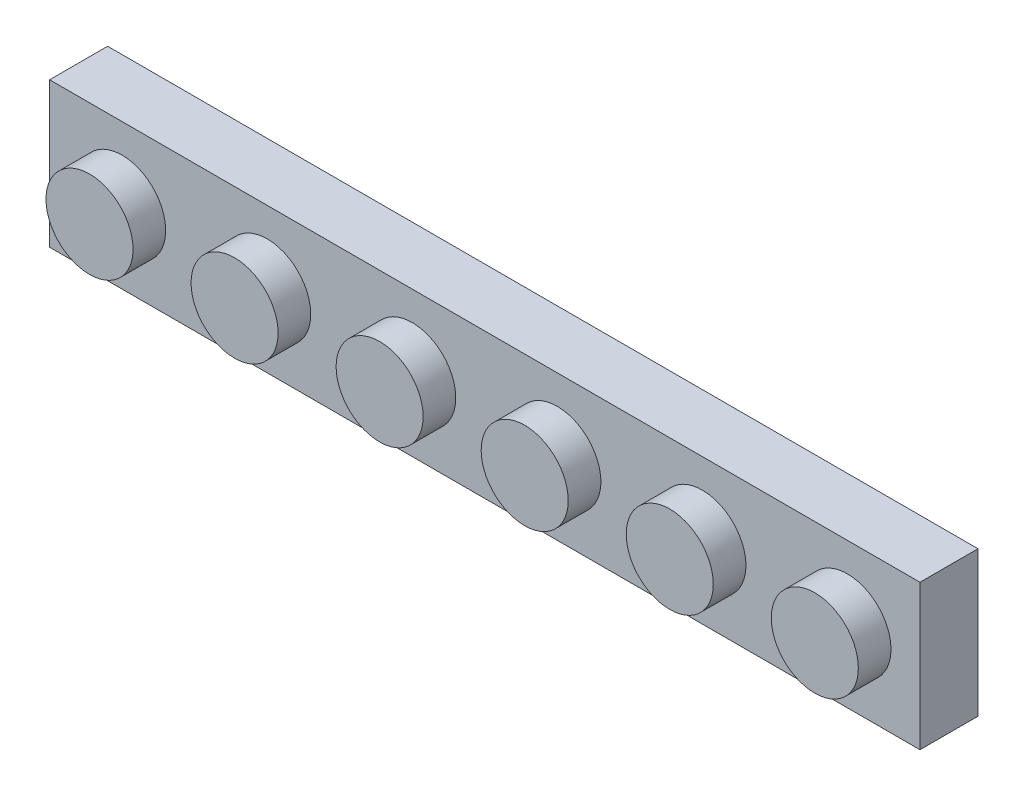
ISO-10303-21;
HEADER;
FILE_DESCRIPTION(('STEP AP214'),'2;1');
FILE_NAME('part.step','',(''),(''),'','','');
FILE_SCHEMA(('AUTOMOTIVE_DESIGN { 1 0 10303 214 1 1 1 1 }'));
ENDSEC;
DATA;
#1=APPLICATION_CONTEXT('core data for automotive mechanical design processes');
#2=APPLICATION_PROTOCOL_DEFINITION('international standard','automotive_design',2000,#1);
#3=PRODUCT_CONTEXT('',#1,'mechanical');
#4=PRODUCT('Part','Part','',(#3));
#5=PRODUCT_RELATED_PRODUCT_CATEGORY('part','',(#4));
#6=PRODUCT_DEFINITION_FORMATION('','',#4);
#7=PRODUCT_DEFINITION_CONTEXT('part definition',#1,'design');
#8=PRODUCT_DEFINITION('design','',#6,#7);
#9=PRODUCT_DEFINITION_SHAPE('','',#8);
#10=(LENGTH_UNIT() NAMED_UNIT(*) SI_UNIT(.MILLI.,.METRE.));
#11=(NAMED_UNIT(*) PLANE_ANGLE_UNIT() SI_UNIT($,.RADIAN.));
#12=(NAMED_UNIT(*) SI_UNIT($,.STERADIAN.) SOLID_ANGLE_UNIT());
#13=UNCERTAINTY_MEASURE_WITH_UNIT(LENGTH_MEASURE(1.E-05),#10,'distance_accuracy_value','');
#14=(GEOMETRIC_REPRESENTATION_CONTEXT(3) GLOBAL_UNCERTAINTY_ASSIGNED_CONTEXT((#13)) GLOBAL_UNIT_ASSIGNED_CONTEXT((#10,
#11,#12)) REPRESENTATION_CONTEXT('',''));
#15=CARTESIAN_POINT('',(0.,0.,0.));
#16=DIRECTION('',(0.,0.,1.));
#17=DIRECTION('',(1.,0.,0.));
#18=AXIS2_PLACEMENT_3D('',#15,#16,#17);
#19=CARTESIAN_POINT('',(44.,4.,5.));
#20=DIRECTION('',(0.,0.,1.));
#21=DIRECTION('',(1.,0.,0.));
#22=AXIS2_PLACEMENT_3D('',#19,#20,#21);
#23=PLANE('',#22);
#24=CARTESIAN_POINT('',(44.,4.,5.));
#25=DIRECTION('',(0.,0.,1.));
#26=DIRECTION('',(1.,0.,0.));
#27=AXIS2_PLACEMENT_3D('',#24,#25,#26);
#28=CIRCLE('',#27,2.4);
#29=CARTESIAN_POINT('',(46.4,4.,5.));
#30=VERTEX_POINT('',#29);
#31=EDGE_CURVE('E11',#30,#30,#28,.T.);
#32=ORIENTED_EDGE('',*,*,#31,.T.);
#33=EDGE_LOOP('',(#32));
#34=FACE_BOUND('',#33,.T.);
#35=ADVANCED_FACE('F34',(#34),#23,.T.);
#36=CARTESIAN_POINT('',(44.,4.,5.));
#37=DIRECTION('',(0.,0.,-1.));
#38=DIRECTION('',(-1.,0.,0.));
#39=AXIS2_PLACEMENT_3D('',#36,#37,#38);
#40=CYLINDRICAL_SURFACE('',#39,2.4);
#41=ORIENTED_EDGE('',*,*,#31,.F.);
#42=EDGE_LOOP('',(#41));
#43=FACE_BOUND('',#42,.T.);
#44=CARTESIAN_POINT('',(44.,4.,3.2));
#45=DIRECTION('',(0.,0.,-1.));
#46=DIRECTION('',(-1.,0.,0.));
#47=AXIS2_PLACEMENT_3D('',#44,#45,#46);
#48=CIRCLE('',#47,2.4);
#49=CARTESIAN_POINT('',(41.6,4.,3.2));
#50=VERTEX_POINT('',#49);
#51=EDGE_CURVE('E41',#50,#50,#48,.F.);
#52=ORIENTED_EDGE('',*,*,#51,.T.);
#53=EDGE_LOOP('',(#52));
#54=FACE_BOUND('',#53,.T.);
#55=ADVANCED_FACE('F198',(#43,#54),#40,.T.);
#56=CARTESIAN_POINT('',(36.,4.,5.));
#57=DIRECTION('',(0.,0.,1.));
#58=DIRECTION('',(1.,0.,0.));
#59=AXIS2_PLACEMENT_3D('',#56,#57,#58);
#60=PLANE('',#59);
#61=CARTESIAN_POINT('',(36.,4.,5.));
#62=DIRECTION('',(0.,0.,1.));
#63=DIRECTION('',(1.,0.,0.));
#64=AXIS2_PLACEMENT_3D('',#61,#62,#63);
#65=CIRCLE('',#64,2.4);
#66=CARTESIAN_POINT('',(38.4,4.,5.));
#67=VERTEX_POINT('',#66);
#68=EDGE_CURVE('E193',#67,#67,#65,.T.);
#69=ORIENTED_EDGE('',*,*,#68,.T.);
#70=EDGE_LOOP('',(#69));
#71=FACE_BOUND('',#70,.T.);
#72=ADVANCED_FACE('F222',(#71),#60,.T.);
#73=CARTESIAN_POINT('',(36.,4.,5.));
#74=DIRECTION('',(0.,0.,-1.));
#75=DIRECTION('',(-1.,0.,0.));
#76=AXIS2_PLACEMENT_3D('',#73,#74,#75);
#77=CYLINDRICAL_SURFACE('',#76,2.4);
#78=ORIENTED_EDGE('',*,*,#68,.F.);
#79=EDGE_LOOP('',(#78));
#80=FACE_BOUND('',#79,.T.);
#81=CARTESIAN_POINT('',(36.,4.,3.2));
#82=DIRECTION('',(0.,0.,-1.));
#83=DIRECTION('',(-1.,0.,0.));
#84=AXIS2_PLACEMENT_3D('',#81,#82,#83);
#85=CIRCLE('',#84,2.4);
#86=CARTESIAN_POINT('',(33.6,4.,3.2));
#87=VERTEX_POINT('',#86);
#88=EDGE_CURVE('E190',#87,#87,#85,.F.);
#89=ORIENTED_EDGE('',*,*,#88,.T.);
#90=EDGE_LOOP('',(#89));
#91=FACE_BOUND('',#90,.T.);
#92=ADVANCED_FACE('F228',(#80,#91),#77,.T.);
#93=CARTESIAN_POINT('',(28.,4.,5.));
#94=DIRECTION('',(0.,0.,1.));
#95=DIRECTION('',(1.,0.,0.));
#96=AXIS2_PLACEMENT_3D('',#93,#94,#95);
#97=PLANE('',#96);
#98=CARTESIAN_POINT('',(28.,4.,5.));
#99=DIRECTION('',(0.,0.,1.));
#100=DIRECTION('',(1.,0.,0.));
#101=AXIS2_PLACEMENT_3D('',#98,#99,#100);
#102=CIRCLE('',#101,2.4);
#103=CARTESIAN_POINT('',(30.4,4.,5.));
#104=VERTEX_POINT('',#103);
#105=EDGE_CURVE('E187',#104,#104,#102,.T.);
#106=ORIENTED_EDGE('',*,*,#105,.T.);
#107=EDGE_LOOP('',(#106));
#108=FACE_BOUND('',#107,.T.);
#109=ADVANCED_FACE('F234',(#108),#97,.T.);
#110=CARTESIAN_POINT('',(28.,4.,5.));
#111=DIRECTION('',(0.,0.,-1.));
#112=DIRECTION('',(-1.,0.,0.));
#113=AXIS2_PLACEMENT_3D('',#110,#111,#112);
#114=CYLINDRICAL_SURFACE('',#113,2.4);
#115=ORIENTED_EDGE('',*,*,#105,.F.);
#116=EDGE_LOOP('',(#115));
#117=FACE_BOUND('',#116,.T.);
#118=CARTESIAN_POINT('',(28.,4.,3.2));
#119=DIRECTION('',(0.,0.,-1.));
#120=DIRECTION('',(-1.,0.,0.));
#121=AXIS2_PLACEMENT_3D('',#118,#119,#120);
#122=CIRCLE('',#121,2.4);
#123=CARTESIAN_POINT('',(25.6,4.,3.2));
#124=VERTEX_POINT('',#123);
#125=EDGE_CURVE('E184',#124,#124,#122,.F.);
#126=ORIENTED_EDGE('',*,*,#125,.T.);
#127=EDGE_LOOP('',(#126));
#128=FACE_BOUND('',#127,.T.);
#129=ADVANCED_FACE('F238',(#117,#128),#114,.T.);
#130=CARTESIAN_POINT('',(20.,4.,5.));
#131=DIRECTION('',(0.,0.,1.));
#132=DIRECTION('',(1.,0.,0.));
#133=AXIS2_PLACEMENT_3D('',#130,#131,#132);
#134=PLANE('',#133);
#135=CARTESIAN_POINT('',(20.,4.,5.));
#136=DIRECTION('',(0.,0.,1.));
#137=DIRECTION('',(1.,0.,0.));
#138=AXIS2_PLACEMENT_3D('',#135,#136,#137);
#139=CIRCLE('',#138,2.4);
#140=CARTESIAN_POINT('',(22.4,4.,5.));
#141=VERTEX_POINT('',#140);
#142=EDGE_CURVE('E181',#141,#141,#139,.T.);
#143=ORIENTED_EDGE('',*,*,#142,.T.);
#144=EDGE_LOOP('',(#143));
#145=FACE_BOUND('',#144,.T.);
#146=ADVANCED_FACE('F242',(#145),#134,.T.);
#147=CARTESIAN_POINT('',(20.,4.,5.));
#148=DIRECTION('',(0.,0.,-1.));
#149=DIRECTION('',(-1.,0.,0.));
#150=AXIS2_PLACEMENT_3D('',#147,#148,#149);
#151=CYLINDRICAL_SURFACE('',#150,2.4);
#152=ORIENTED_EDGE('',*,*,#142,.F.);
#153=EDGE_LOOP('',(#152));
#154=FACE_BOUND('',#153,.T.);
#155=CARTESIAN_POINT('',(20.,4.,3.2));
#156=DIRECTION('',(0.,0.,-1.));
#157=DIRECTION('',(-1.,0.,0.));
#158=AXIS2_PLACEMENT_3D('',#155,#156,#157);
#159=CIRCLE('',#158,2.4);
#160=CARTESIAN_POINT('',(17.6,4.,3.2));
#161=VERTEX_POINT('',#160);
#162=EDGE_CURVE('E178',#161,#161,#159,.F.);
#163=ORIENTED_EDGE('',*,*,#162,.T.);
#164=EDGE_LOOP('',(#163));
#165=FACE_BOUND('',#164,.T.);
#166=ADVANCED_FACE('F246',(#154,#165),#151,.T.);
#167=CARTESIAN_POINT('',(0.,0.,3.2));
#168=DIRECTION('',(1.,0.,0.));
#169=DIRECTION('',(0.,0.,-1.));
#170=AXIS2_PLACEMENT_3D('',#167,#168,#169);
#171=PLANE('',#170);
#172=DIRECTION('',(0.,-1.,0.));
#173=VECTOR('',#172,1.);
#174=CARTESIAN_POINT('',(0.,0.,0.));
#175=LINE('',#174,#173);
#176=CARTESIAN_POINT('',(0.,8.,0.));
#177=VERTEX_POINT('',#176);
#178=CARTESIAN_POINT('',(0.,0.,0.));
#179=VERTEX_POINT('',#178);
#180=EDGE_CURVE('E146',#177,#179,#175,.T.);
#181=ORIENTED_EDGE('',*,*,#180,.T.);
#182=DIRECTION('',(0.,0.,-1.));
#183=VECTOR('',#182,1.);
#184=CARTESIAN_POINT('',(0.,0.,3.2));
#185=LINE('',#184,#183);
#186=CARTESIAN_POINT('',(0.,0.,3.2));
#187=VERTEX_POINT('',#186);
#188=EDGE_CURVE('E170',#187,#179,#185,.T.);
#189=ORIENTED_EDGE('',*,*,#188,.F.);
#190=DIRECTION('',(0.,-1.,0.));
#191=VECTOR('',#190,1.);
#192=CARTESIAN_POINT('',(0.,0.,3.2));
#193=LINE('',#192,#191);
#194=CARTESIAN_POINT('',(0.,8.,3.2));
#195=VERTEX_POINT('',#194);
#196=EDGE_CURVE('E150',#195,#187,#193,.T.);
#197=ORIENTED_EDGE('',*,*,#196,.F.);
#198=DIRECTION('',(0.,0.,-1.));
#199=VECTOR('',#198,1.);
#200=CARTESIAN_POINT('',(0.,8.,3.2));
#201=LINE('',#200,#199);
#202=EDGE_CURVE('E156',#195,#177,#201,.T.);
#203=ORIENTED_EDGE('',*,*,#202,.T.);
#204=EDGE_LOOP('',(#181,#189,#197,#203));
#205=FACE_BOUND('',#204,.T.);
#206=ADVANCED_FACE('F250',(#205),#171,.F.);
#207=CARTESIAN_POINT('',(0.,0.,3.2));
#208=DIRECTION('',(0.,1.,0.));
#209=DIRECTION('',(0.,0.,1.));
#210=AXIS2_PLACEMENT_3D('',#207,#208,#209);
#211=PLANE('',#210);
#212=DIRECTION('',(1.,0.,0.));
#213=VECTOR('',#212,1.);
#214=CARTESIAN_POINT('',(0.,0.,0.));
#215=LINE('',#214,#213);
#216=CARTESIAN_POINT('',(48.,0.,0.));
#217=VERTEX_POINT('',#216);
#218=EDGE_CURVE('E159',#179,#217,#215,.T.);
#219=ORIENTED_EDGE('',*,*,#218,.T.);
#220=DIRECTION('',(0.,0.,-1.));
#221=VECTOR('',#220,1.);
#222=CARTESIAN_POINT('',(48.,0.,3.2));
#223=LINE('',#222,#221);
#224=CARTESIAN_POINT('',(48.,0.,3.2));
#225=VERTEX_POINT('',#224);
#226=EDGE_CURVE('E167',#225,#217,#223,.T.);
#227=ORIENTED_EDGE('',*,*,#226,.F.);
#228=DIRECTION('',(1.,0.,0.));
#229=VECTOR('',#228,1.);
#230=CARTESIAN_POINT('',(0.,0.,3.2));
#231=LINE('',#230,#229);
#232=EDGE_CURVE('E86',#187,#225,#231,.T.);
#233=ORIENTED_EDGE('',*,*,#232,.F.);
#234=ORIENTED_EDGE('',*,*,#188,.T.);
#235=EDGE_LOOP('',(#219,#227,#233,#234));
#236=FACE_BOUND('',#235,.T.);
#237=ADVANCED_FACE('F254',(#236),#211,.F.);
#238=CARTESIAN_POINT('',(48.,0.,3.2));
#239=DIRECTION('',(-1.,0.,0.));
#240=DIRECTION('',(0.,0.,1.));
#241=AXIS2_PLACEMENT_3D('',#238,#239,#240);
#242=PLANE('',#241);
#243=DIRECTION('',(0.,1.,0.));
#244=VECTOR('',#243,1.);
#245=CARTESIAN_POINT('',(48.,0.,0.));
#246=LINE('',#245,#244);
#247=CARTESIAN_POINT('',(48.,8.,0.));
#248=VERTEX_POINT('',#247);
#249=EDGE_CURVE('E161',#217,#248,#246,.T.);
#250=ORIENTED_EDGE('',*,*,#249,.T.);
#251=DIRECTION('',(0.,0.,-1.));
#252=VECTOR('',#251,1.);
#253=CARTESIAN_POINT('',(48.,8.,3.2));
#254=LINE('',#253,#252);
#255=CARTESIAN_POINT('',(48.,8.,3.2));
#256=VERTEX_POINT('',#255);
#257=EDGE_CURVE('E165',#256,#248,#254,.T.);
#258=ORIENTED_EDGE('',*,*,#257,.F.);
#259=DIRECTION('',(0.,1.,0.));
#260=VECTOR('',#259,1.);
#261=CARTESIAN_POINT('',(48.,0.,3.2));
#262=LINE('',#261,#260);
#263=EDGE_CURVE('E153',#225,#256,#262,.T.);
#264=ORIENTED_EDGE('',*,*,#263,.F.);
#265=ORIENTED_EDGE('',*,*,#226,.T.);
#266=EDGE_LOOP('',(#250,#258,#264,#265));
#267=FACE_BOUND('',#266,.T.);
#268=ADVANCED_FACE('F212',(#267),#242,.F.);
#269=CARTESIAN_POINT('',(0.,8.,3.2));
#270=DIRECTION('',(0.,-1.,0.));
#271=DIRECTION('',(0.,0.,-1.));
#272=AXIS2_PLACEMENT_3D('',#269,#270,#271);
#273=PLANE('',#272);
#274=DIRECTION('',(-1.,0.,0.));
#275=VECTOR('',#274,1.);
#276=CARTESIAN_POINT('',(0.,8.,0.));
#277=LINE('',#276,#275);
#278=EDGE_CURVE('E78',#248,#177,#277,.T.);
#279=ORIENTED_EDGE('',*,*,#278,.T.);
#280=ORIENTED_EDGE('',*,*,#202,.F.);
#281=DIRECTION('',(-1.,0.,0.));
#282=VECTOR('',#281,1.);
#283=CARTESIAN_POINT('',(0.,8.,3.2));
#284=LINE('',#283,#282);
#285=EDGE_CURVE('E57',#256,#195,#284,.T.);
#286=ORIENTED_EDGE('',*,*,#285,.F.);
#287=ORIENTED_EDGE('',*,*,#257,.T.);
#288=EDGE_LOOP('',(#279,#280,#286,#287));
#289=FACE_BOUND('',#288,.T.);
#290=ADVANCED_FACE('F203',(#289),#273,.F.);
#291=CARTESIAN_POINT('',(0.,0.,3.2));
#292=DIRECTION('',(0.,0.,-1.));
#293=DIRECTION('',(-1.,0.,0.));
#294=AXIS2_PLACEMENT_3D('',#291,#292,#293);
#295=PLANE('',#294);
#296=CARTESIAN_POINT('',(12.,4.,3.2));
#297=DIRECTION('',(0.,0.,-1.));
#298=DIRECTION('',(-1.,0.,0.));
#299=AXIS2_PLACEMENT_3D('',#296,#297,#298);
#300=CIRCLE('',#299,2.4);
#301=CARTESIAN_POINT('',(9.6,4.,3.2));
#302=VERTEX_POINT('',#301);
#303=EDGE_CURVE('E175',#302,#302,#300,.F.);
#304=ORIENTED_EDGE('',*,*,#303,.F.);
#305=EDGE_LOOP('',(#304));
#306=FACE_BOUND('',#305,.T.);
#307=CARTESIAN_POINT('',(4.,4.,3.2));
#308=DIRECTION('',(0.,0.,-1.));
#309=DIRECTION('',(-1.,0.,0.));
#310=AXIS2_PLACEMENT_3D('',#307,#308,#309);
#311=CIRCLE('',#310,2.4);
#312=CARTESIAN_POINT('',(1.6,4.,3.2));
#313=VERTEX_POINT('',#312);
#314=EDGE_CURVE('E172',#313,#313,#311,.F.);
#315=ORIENTED_EDGE('',*,*,#314,.F.);
#316=EDGE_LOOP('',(#315));
#317=FACE_BOUND('',#316,.T.);
#318=ORIENTED_EDGE('',*,*,#196,.T.);
#319=ORIENTED_EDGE('',*,*,#232,.T.);
#320=ORIENTED_EDGE('',*,*,#263,.T.);
#321=ORIENTED_EDGE('',*,*,#285,.T.);
#322=EDGE_LOOP('',(#318,#319,#320,#321));
#323=FACE_BOUND('',#322,.T.);
#324=ORIENTED_EDGE('',*,*,#162,.F.);
#325=EDGE_LOOP('',(#324));
#326=FACE_BOUND('',#325,.T.);
#327=ORIENTED_EDGE('',*,*,#125,.F.);
#328=EDGE_LOOP('',(#327));
#329=FACE_BOUND('',#328,.T.);
#330=ORIENTED_EDGE('',*,*,#88,.F.);
#331=EDGE_LOOP('',(#330));
#332=FACE_BOUND('',#331,.T.);
#333=ORIENTED_EDGE('',*,*,#51,.F.);
#334=EDGE_LOOP('',(#333));
#335=FACE_BOUND('',#334,.T.);
#336=ADVANCED_FACE('F200',(#306,#317,#323,#326,#329,#332,#335),#295,.F.);
#337=CARTESIAN_POINT('',(0.,0.,0.));
#338=DIRECTION('',(0.,0.,-1.));
#339=DIRECTION('',(-1.,0.,0.));
#340=AXIS2_PLACEMENT_3D('',#337,#338,#339);
#341=PLANE('',#340);
#342=DIRECTION('',(0.,-1.,0.));
#343=VECTOR('',#342,1.);
#344=CARTESIAN_POINT('',(46.5,6.5,0.));
#345=LINE('',#344,#343);
#346=CARTESIAN_POINT('',(46.5,6.5,0.));
#347=VERTEX_POINT('',#346);
#348=CARTESIAN_POINT('',(46.5,1.5,0.));
#349=VERTEX_POINT('',#348);
#350=EDGE_CURVE('E48',#347,#349,#345,.T.);
#351=ORIENTED_EDGE('',*,*,#350,.F.);
#352=DIRECTION('',(1.,0.,0.));
#353=VECTOR('',#352,1.);
#354=CARTESIAN_POINT('',(46.5,6.5,0.));
#355=LINE('',#354,#353);
#356=CARTESIAN_POINT('',(1.5,6.5,0.));
#357=VERTEX_POINT('',#356);
#358=EDGE_CURVE('E128',#357,#347,#355,.T.);
#359=ORIENTED_EDGE('',*,*,#358,.F.);
#360=DIRECTION('',(0.,1.,0.));
#361=VECTOR('',#360,1.);
#362=CARTESIAN_POINT('',(1.5,6.5,0.));
#363=LINE('',#362,#361);
#364=CARTESIAN_POINT('',(1.5,1.5,0.));
#365=VERTEX_POINT('',#364);
#366=EDGE_CURVE('E131',#365,#357,#363,.T.);
#367=ORIENTED_EDGE('',*,*,#366,.F.);
#368=DIRECTION('',(-1.,0.,0.));
#369=VECTOR('',#368,1.);
#370=CARTESIAN_POINT('',(46.5,1.5,0.));
#371=LINE('',#370,#369);
#372=EDGE_CURVE('E140',#349,#365,#371,.T.);
#373=ORIENTED_EDGE('',*,*,#372,.F.);
#374=EDGE_LOOP('',(#351,#359,#367,#373));
#375=FACE_BOUND('',#374,.T.);
#376=ORIENTED_EDGE('',*,*,#180,.F.);
#377=ORIENTED_EDGE('',*,*,#278,.F.);
#378=ORIENTED_EDGE('',*,*,#249,.F.);
#379=ORIENTED_EDGE('',*,*,#218,.F.);
#380=EDGE_LOOP('',(#376,#377,#378,#379));
#381=FACE_BOUND('',#380,.T.);
#382=ADVANCED_FACE('F202',(#375,#381),#341,.T.);
#383=CARTESIAN_POINT('',(46.5,6.5,3.1));
#384=DIRECTION('',(1.,0.,0.));
#385=DIRECTION('',(0.,0.,-1.));
#386=AXIS2_PLACEMENT_3D('',#383,#384,#385);
#387=PLANE('',#386);
#388=ORIENTED_EDGE('',*,*,#350,.T.);
#389=DIRECTION('',(0.,0.,-1.));
#390=VECTOR('',#389,1.);
#391=CARTESIAN_POINT('',(46.5,1.5,3.1));
#392=LINE('',#391,#390);
#393=CARTESIAN_POINT('',(46.5,1.5,3.1));
#394=VERTEX_POINT('',#393);
#395=EDGE_CURVE('E106',#394,#349,#392,.T.);
#396=ORIENTED_EDGE('',*,*,#395,.F.);
#397=DIRECTION('',(0.,-1.,0.));
#398=VECTOR('',#397,1.);
#399=CARTESIAN_POINT('',(46.5,6.5,3.1));
#400=LINE('',#399,#398);
#401=CARTESIAN_POINT('',(46.5,6.5,3.1));
#402=VERTEX_POINT('',#401);
#403=EDGE_CURVE('E110',#402,#394,#400,.T.);
#404=ORIENTED_EDGE('',*,*,#403,.F.);
#405=DIRECTION('',(0.,0.,-1.));
#406=VECTOR('',#405,1.);
#407=CARTESIAN_POINT('',(46.5,6.5,3.1));
#408=LINE('',#407,#406);
#409=EDGE_CURVE('E144',#402,#347,#408,.T.);
#410=ORIENTED_EDGE('',*,*,#409,.T.);
#411=EDGE_LOOP('',(#388,#396,#404,#410));
#412=FACE_BOUND('',#411,.T.);
#413=ADVANCED_FACE('F108',(#412),#387,.F.);
#414=CARTESIAN_POINT('',(46.5,6.5,3.1));
#415=DIRECTION('',(0.,1.,0.));
#416=DIRECTION('',(0.,0.,1.));
#417=AXIS2_PLACEMENT_3D('',#414,#415,#416);
#418=PLANE('',#417);
#419=ORIENTED_EDGE('',*,*,#358,.T.);
#420=ORIENTED_EDGE('',*,*,#409,.F.);
#421=DIRECTION('',(1.,0.,0.));
#422=VECTOR('',#421,1.);
#423=CARTESIAN_POINT('',(46.5,6.5,3.1));
#424=LINE('',#423,#422);
#425=CARTESIAN_POINT('',(1.5,6.5,3.1));
#426=VERTEX_POINT('',#425);
#427=EDGE_CURVE('E116',#426,#402,#424,.T.);
#428=ORIENTED_EDGE('',*,*,#427,.F.);
#429=DIRECTION('',(0.,0.,-1.));
#430=VECTOR('',#429,1.);
#431=CARTESIAN_POINT('',(1.5,6.5,3.1));
#432=LINE('',#431,#430);
#433=EDGE_CURVE('E147',#426,#357,#432,.T.);
#434=ORIENTED_EDGE('',*,*,#433,.T.);
#435=EDGE_LOOP('',(#419,#420,#428,#434));
#436=FACE_BOUND('',#435,.T.);
#437=ADVANCED_FACE('F302',(#436),#418,.F.);
#438=CARTESIAN_POINT('',(1.5,6.5,3.1));
#439=DIRECTION('',(-1.,0.,0.));
#440=DIRECTION('',(0.,0.,1.));
#441=AXIS2_PLACEMENT_3D('',#438,#439,#440);
#442=PLANE('',#441);
#443=ORIENTED_EDGE('',*,*,#366,.T.);
#444=ORIENTED_EDGE('',*,*,#433,.F.);
#445=DIRECTION('',(0.,1.,0.));
#446=VECTOR('',#445,1.);
#447=CARTESIAN_POINT('',(1.5,6.5,3.1));
#448=LINE('',#447,#446);
#449=CARTESIAN_POINT('',(1.5,1.5,3.1));
#450=VERTEX_POINT('',#449);
#451=EDGE_CURVE('E124',#450,#426,#448,.T.);
#452=ORIENTED_EDGE('',*,*,#451,.F.);
#453=DIRECTION('',(0.,0.,-1.));
#454=VECTOR('',#453,1.);
#455=CARTESIAN_POINT('',(1.5,1.5,3.1));
#456=LINE('',#455,#454);
#457=EDGE_CURVE('E115',#450,#365,#456,.T.);
#458=ORIENTED_EDGE('',*,*,#457,.T.);
#459=EDGE_LOOP('',(#443,#444,#452,#458));
#460=FACE_BOUND('',#459,.T.);
#461=ADVANCED_FACE('F310',(#460),#442,.F.);
#462=CARTESIAN_POINT('',(46.5,1.5,3.1));
#463=DIRECTION('',(0.,-1.,0.));
#464=DIRECTION('',(0.,0.,-1.));
#465=AXIS2_PLACEMENT_3D('',#462,#463,#464);
#466=PLANE('',#465);
#467=ORIENTED_EDGE('',*,*,#372,.T.);
#468=ORIENTED_EDGE('',*,*,#457,.F.);
#469=DIRECTION('',(-1.,0.,0.));
#470=VECTOR('',#469,1.);
#471=CARTESIAN_POINT('',(46.5,1.5,3.1));
#472=LINE('',#471,#470);
#473=EDGE_CURVE('E119',#394,#450,#472,.T.);
#474=ORIENTED_EDGE('',*,*,#473,.F.);
#475=ORIENTED_EDGE('',*,*,#395,.T.);
#476=EDGE_LOOP('',(#467,#468,#474,#475));
#477=FACE_BOUND('',#476,.T.);
#478=ADVANCED_FACE('F120',(#477),#466,.F.);
#479=CARTESIAN_POINT('',(0.,0.,3.1));
#480=DIRECTION('',(0.,0.,-1.));
#481=DIRECTION('',(-1.,0.,0.));
#482=AXIS2_PLACEMENT_3D('',#479,#480,#481);
#483=PLANE('',#482);
#484=CARTESIAN_POINT('',(39.95,3.9,3.1));
#485=DIRECTION('',(0.,0.,-1.));
#486=DIRECTION('',(-1.,0.,0.));
#487=AXIS2_PLACEMENT_3D('',#484,#485,#486);
#488=CIRCLE('',#487,0.840670682775214);
#489=CARTESIAN_POINT('',(39.1093293172248,3.9,3.1));
#490=VERTEX_POINT('',#489);
#491=EDGE_CURVE('E532',#490,#490,#488,.T.);
#492=ORIENTED_EDGE('',*,*,#491,.F.);
#493=EDGE_LOOP('',(#492));
#494=FACE_BOUND('',#493,.T.);
#495=CARTESIAN_POINT('',(31.95,3.9,3.1));
#496=DIRECTION('',(0.,0.,-1.));
#497=DIRECTION('',(-1.,0.,0.));
#498=AXIS2_PLACEMENT_3D('',#495,#496,#497);
#499=CIRCLE('',#498,0.840670682775214);
#500=CARTESIAN_POINT('',(31.1093293172248,3.9,3.1));
#501=VERTEX_POINT('',#500);
#502=EDGE_CURVE('E531',#501,#501,#499,.T.);
#503=ORIENTED_EDGE('',*,*,#502,.F.);
#504=EDGE_LOOP('',(#503));
#505=FACE_BOUND('',#504,.T.);
#506=CARTESIAN_POINT('',(23.95,3.9,3.1));
#507=DIRECTION('',(0.,0.,-1.));
#508=DIRECTION('',(-1.,0.,0.));
#509=AXIS2_PLACEMENT_3D('',#506,#507,#508);
#510=CIRCLE('',#509,0.840670682775214);
#511=CARTESIAN_POINT('',(23.1093293172248,3.9,3.1));
#512=VERTEX_POINT('',#511);
#513=EDGE_CURVE('E541',#512,#512,#510,.T.);
#514=ORIENTED_EDGE('',*,*,#513,.F.);
#515=EDGE_LOOP('',(#514));
#516=FACE_BOUND('',#515,.T.);
#517=CARTESIAN_POINT('',(15.95,3.9,3.1));
#518=DIRECTION('',(0.,0.,-1.));
#519=DIRECTION('',(-1.,0.,0.));
#520=AXIS2_PLACEMENT_3D('',#517,#518,#519);
#521=CIRCLE('',#520,0.840670682775214);
#522=CARTESIAN_POINT('',(15.1093293172248,3.9,3.1));
#523=VERTEX_POINT('',#522);
#524=EDGE_CURVE('E546',#523,#523,#521,.T.);
#525=ORIENTED_EDGE('',*,*,#524,.F.);
#526=EDGE_LOOP('',(#525));
#527=FACE_BOUND('',#526,.T.);
#528=CARTESIAN_POINT('',(7.95,3.9,3.1));
#529=DIRECTION('',(0.,0.,-1.));
#530=DIRECTION('',(-1.,0.,0.));
#531=AXIS2_PLACEMENT_3D('',#528,#529,#530);
#532=CIRCLE('',#531,0.840670682775214);
#533=CARTESIAN_POINT('',(7.10932931722479,3.9,3.1));
#534=VERTEX_POINT('',#533);
#535=EDGE_CURVE('E552',#534,#534,#532,.T.);
#536=ORIENTED_EDGE('',*,*,#535,.F.);
#537=EDGE_LOOP('',(#536));
#538=FACE_BOUND('',#537,.T.);
#539=ORIENTED_EDGE('',*,*,#403,.T.);
#540=ORIENTED_EDGE('',*,*,#473,.T.);
#541=ORIENTED_EDGE('',*,*,#451,.T.);
#542=ORIENTED_EDGE('',*,*,#427,.T.);
#543=EDGE_LOOP('',(#539,#540,#541,#542));
#544=FACE_BOUND('',#543,.T.);
#545=ADVANCED_FACE('F126',(#494,#505,#516,#527,#538,#544),#483,.T.);
#546=CARTESIAN_POINT('',(4.,4.,5.));
#547=DIRECTION('',(0.,0.,-1.));
#548=DIRECTION('',(-1.,0.,0.));
#549=AXIS2_PLACEMENT_3D('',#546,#547,#548);
#550=CYLINDRICAL_SURFACE('',#549,2.4);
#551=CARTESIAN_POINT('',(4.,4.,5.));
#552=DIRECTION('',(0.,0.,1.));
#553=DIRECTION('',(1.,0.,0.));
#554=AXIS2_PLACEMENT_3D('',#551,#552,#553);
#555=CIRCLE('',#554,2.4);
#556=CARTESIAN_POINT('',(6.4,4.,5.));
#557=VERTEX_POINT('',#556);
#558=EDGE_CURVE('E134',#557,#557,#555,.T.);
#559=ORIENTED_EDGE('',*,*,#558,.F.);
#560=EDGE_LOOP('',(#559));
#561=FACE_BOUND('',#560,.T.);
#562=ORIENTED_EDGE('',*,*,#314,.T.);
#563=EDGE_LOOP('',(#562));
#564=FACE_BOUND('',#563,.T.);
#565=ADVANCED_FACE('F335',(#561,#564),#550,.T.);
#566=CARTESIAN_POINT('',(4.,4.,5.));
#567=DIRECTION('',(0.,0.,1.));
#568=DIRECTION('',(1.,0.,0.));
#569=AXIS2_PLACEMENT_3D('',#566,#567,#568);
#570=PLANE('',#569);
#571=ORIENTED_EDGE('',*,*,#558,.T.);
#572=EDGE_LOOP('',(#571));
#573=FACE_BOUND('',#572,.T.);
#574=ADVANCED_FACE('F340',(#573),#570,.T.);
#575=CARTESIAN_POINT('',(12.,4.,5.));
#576=DIRECTION('',(0.,0.,-1.));
#577=DIRECTION('',(-1.,0.,0.));
#578=AXIS2_PLACEMENT_3D('',#575,#576,#577);
#579=CYLINDRICAL_SURFACE('',#578,2.4);
#580=CARTESIAN_POINT('',(12.,4.,5.));
#581=DIRECTION('',(0.,0.,1.));
#582=DIRECTION('',(1.,0.,0.));
#583=AXIS2_PLACEMENT_3D('',#580,#581,#582);
#584=CIRCLE('',#583,2.4);
#585=CARTESIAN_POINT('',(14.4,4.,5.));
#586=VERTEX_POINT('',#585);
#587=EDGE_CURVE('E558',#586,#586,#584,.T.);
#588=ORIENTED_EDGE('',*,*,#587,.F.);
#589=EDGE_LOOP('',(#588));
#590=FACE_BOUND('',#589,.T.);
#591=ORIENTED_EDGE('',*,*,#303,.T.);
#592=EDGE_LOOP('',(#591));
#593=FACE_BOUND('',#592,.T.);
#594=ADVANCED_FACE('F349',(#590,#593),#579,.T.);
#595=CARTESIAN_POINT('',(12.,4.,5.));
#596=DIRECTION('',(0.,0.,1.));
#597=DIRECTION('',(1.,0.,0.));
#598=AXIS2_PLACEMENT_3D('',#595,#596,#597);
#599=PLANE('',#598);
#600=ORIENTED_EDGE('',*,*,#587,.T.);
#601=EDGE_LOOP('',(#600));
#602=FACE_BOUND('',#601,.T.);
#603=ADVANCED_FACE('F407',(#602),#599,.T.);
#604=CARTESIAN_POINT('',(7.95,3.9,0.));
#605=DIRECTION('',(0.,0.,1.));
#606=DIRECTION('',(1.,0.,0.));
#607=AXIS2_PLACEMENT_3D('',#604,#605,#606);
#608=CYLINDRICAL_SURFACE('',#607,0.840670682775214);
#609=CARTESIAN_POINT('',(7.95,3.9,0.));
#610=DIRECTION('',(0.,0.,-1.));
#611=DIRECTION('',(-1.,0.,0.));
#612=AXIS2_PLACEMENT_3D('',#609,#610,#611);
#613=CIRCLE('',#612,0.840670682775214);
#614=CARTESIAN_POINT('',(7.10932931722479,3.9,0.));
#615=VERTEX_POINT('',#614);
#616=EDGE_CURVE('E555',#615,#615,#613,.T.);
#617=ORIENTED_EDGE('',*,*,#616,.F.);
#618=EDGE_LOOP('',(#617));
#619=FACE_BOUND('',#618,.T.);
#620=ORIENTED_EDGE('',*,*,#535,.T.);
#621=EDGE_LOOP('',(#620));
#622=FACE_BOUND('',#621,.T.);
#623=ADVANCED_FACE('F417',(#619,#622),#608,.T.);
#624=CARTESIAN_POINT('',(7.95,3.9,0.));
#625=DIRECTION('',(0.,0.,-1.));
#626=DIRECTION('',(-1.,0.,0.));
#627=AXIS2_PLACEMENT_3D('',#624,#625,#626);
#628=PLANE('',#627);
#629=ORIENTED_EDGE('',*,*,#616,.T.);
#630=EDGE_LOOP('',(#629));
#631=FACE_BOUND('',#630,.T.);
#632=ADVANCED_FACE('F427',(#631),#628,.T.);
#633=CARTESIAN_POINT('',(15.95,3.9,0.));
#634=DIRECTION('',(0.,0.,1.));
#635=DIRECTION('',(1.,0.,0.));
#636=AXIS2_PLACEMENT_3D('',#633,#634,#635);
#637=CYLINDRICAL_SURFACE('',#636,0.840670682775214);
#638=CARTESIAN_POINT('',(15.95,3.9,0.));
#639=DIRECTION('',(0.,0.,-1.));
#640=DIRECTION('',(-1.,0.,0.));
#641=AXIS2_PLACEMENT_3D('',#638,#639,#640);
#642=CIRCLE('',#641,0.840670682775214);
#643=CARTESIAN_POINT('',(15.1093293172248,3.9,0.));
#644=VERTEX_POINT('',#643);
#645=EDGE_CURVE('E549',#644,#644,#642,.T.);
#646=ORIENTED_EDGE('',*,*,#645,.F.);
#647=EDGE_LOOP('',(#646));
#648=FACE_BOUND('',#647,.T.);
#649=ORIENTED_EDGE('',*,*,#524,.T.);
#650=EDGE_LOOP('',(#649));
#651=FACE_BOUND('',#650,.T.);
#652=ADVANCED_FACE('F437',(#648,#651),#637,.T.);
#653=CARTESIAN_POINT('',(15.95,3.9,0.));
#654=DIRECTION('',(0.,0.,-1.));
#655=DIRECTION('',(-1.,0.,0.));
#656=AXIS2_PLACEMENT_3D('',#653,#654,#655);
#657=PLANE('',#656);
#658=ORIENTED_EDGE('',*,*,#645,.T.);
#659=EDGE_LOOP('',(#658));
#660=FACE_BOUND('',#659,.T.);
#661=ADVANCED_FACE('F454',(#660),#657,.T.);
#662=CARTESIAN_POINT('',(23.95,3.9,0.));
#663=DIRECTION('',(0.,0.,1.));
#664=DIRECTION('',(1.,0.,0.));
#665=AXIS2_PLACEMENT_3D('',#662,#663,#664);
#666=CYLINDRICAL_SURFACE('',#665,0.840670682775214);
#667=CARTESIAN_POINT('',(23.95,3.9,0.));
#668=DIRECTION('',(0.,0.,-1.));
#669=DIRECTION('',(-1.,0.,0.));
#670=AXIS2_PLACEMENT_3D('',#667,#668,#669);
#671=CIRCLE('',#670,0.840670682775214);
#672=CARTESIAN_POINT('',(23.1093293172248,3.9,0.));
#673=VERTEX_POINT('',#672);
#674=EDGE_CURVE('E543',#673,#673,#671,.T.);
#675=ORIENTED_EDGE('',*,*,#674,.F.);
#676=EDGE_LOOP('',(#675));
#677=FACE_BOUND('',#676,.T.);
#678=ORIENTED_EDGE('',*,*,#513,.T.);
#679=EDGE_LOOP('',(#678));
#680=FACE_BOUND('',#679,.T.);
#681=ADVANCED_FACE('F464',(#677,#680),#666,.T.);
#682=CARTESIAN_POINT('',(23.95,3.9,0.));
#683=DIRECTION('',(0.,0.,-1.));
#684=DIRECTION('',(-1.,0.,0.));
#685=AXIS2_PLACEMENT_3D('',#682,#683,#684);
#686=PLANE('',#685);
#687=ORIENTED_EDGE('',*,*,#674,.T.);
#688=EDGE_LOOP('',(#687));
#689=FACE_BOUND('',#688,.T.);
#690=ADVANCED_FACE('F474',(#689),#686,.T.);
#691=CARTESIAN_POINT('',(31.95,3.9,0.));
#692=DIRECTION('',(0.,0.,1.));
#693=DIRECTION('',(1.,0.,0.));
#694=AXIS2_PLACEMENT_3D('',#691,#692,#693);
#695=CYLINDRICAL_SURFACE('',#694,0.840670682775214);
#696=CARTESIAN_POINT('',(31.95,3.9,0.));
#697=DIRECTION('',(0.,0.,-1.));
#698=DIRECTION('',(-1.,0.,0.));
#699=AXIS2_PLACEMENT_3D('',#696,#697,#698);
#700=CIRCLE('',#699,0.840670682775214);
#701=CARTESIAN_POINT('',(31.1093293172248,3.9,0.));
#702=VERTEX_POINT('',#701);
#703=EDGE_CURVE('E535',#702,#702,#700,.T.);
#704=ORIENTED_EDGE('',*,*,#703,.F.);
#705=EDGE_LOOP('',(#704));
#706=FACE_BOUND('',#705,.T.);
#707=ORIENTED_EDGE('',*,*,#502,.T.);
#708=EDGE_LOOP('',(#707));
#709=FACE_BOUND('',#708,.T.);
#710=ADVANCED_FACE('F484',(#706,#709),#695,.T.);
#711=CARTESIAN_POINT('',(31.95,3.9,0.));
#712=DIRECTION('',(0.,0.,-1.));
#713=DIRECTION('',(-1.,0.,0.));
#714=AXIS2_PLACEMENT_3D('',#711,#712,#713);
#715=PLANE('',#714);
#716=ORIENTED_EDGE('',*,*,#703,.T.);
#717=EDGE_LOOP('',(#716));
#718=FACE_BOUND('',#717,.T.);
#719=ADVANCED_FACE('F494',(#718),#715,.T.);
#720=CARTESIAN_POINT('',(39.95,3.9,0.));
#721=DIRECTION('',(0.,0.,1.));
#722=DIRECTION('',(1.,0.,0.));
#723=AXIS2_PLACEMENT_3D('',#720,#721,#722);
#724=CYLINDRICAL_SURFACE('',#723,0.840670682775214);
#725=CARTESIAN_POINT('',(39.95,3.9,0.));
#726=DIRECTION('',(0.,0.,-1.));
#727=DIRECTION('',(-1.,0.,0.));
#728=AXIS2_PLACEMENT_3D('',#725,#726,#727);
#729=CIRCLE('',#728,0.840670682775214);
#730=CARTESIAN_POINT('',(39.1093293172248,3.9,0.));
#731=VERTEX_POINT('',#730);
#732=EDGE_CURVE('E530',#731,#731,#729,.T.);
#733=ORIENTED_EDGE('',*,*,#732,.F.);
#734=EDGE_LOOP('',(#733));
#735=FACE_BOUND('',#734,.T.);
#736=ORIENTED_EDGE('',*,*,#491,.T.);
#737=EDGE_LOOP('',(#736));
#738=FACE_BOUND('',#737,.T.);
#739=ADVANCED_FACE('F504',(#735,#738),#724,.T.);
#740=CARTESIAN_POINT('',(39.95,3.9,0.));
#741=DIRECTION('',(0.,0.,-1.));
#742=DIRECTION('',(-1.,0.,0.));
#743=AXIS2_PLACEMENT_3D('',#740,#741,#742);
#744=PLANE('',#743);
#745=ORIENTED_EDGE('',*,*,#732,.T.);
#746=EDGE_LOOP('',(#745));
#747=FACE_BOUND('',#746,.T.);
#748=ADVANCED_FACE('F514',(#747),#744,.T.);
#749=CLOSED_SHELL('',(#35,#55,#72,#92,#109,#129,#146,#166,#206,#237,#268,#290,#336,#382,#413,
#437,#461,#478,#545,#565,#574,#594,#603,#623,#632,#652,#661,#681,#690,#710,#719,#739,#748));
#750=MANIFOLD_SOLID_BREP('B2',#749);
#751=ADVANCED_BREP_SHAPE_REPRESENTATION('',(#18,#750),#14);
#752=SHAPE_DEFINITION_REPRESENTATION(#9,#751);
ENDSEC;
END-ISO-10303-21;
